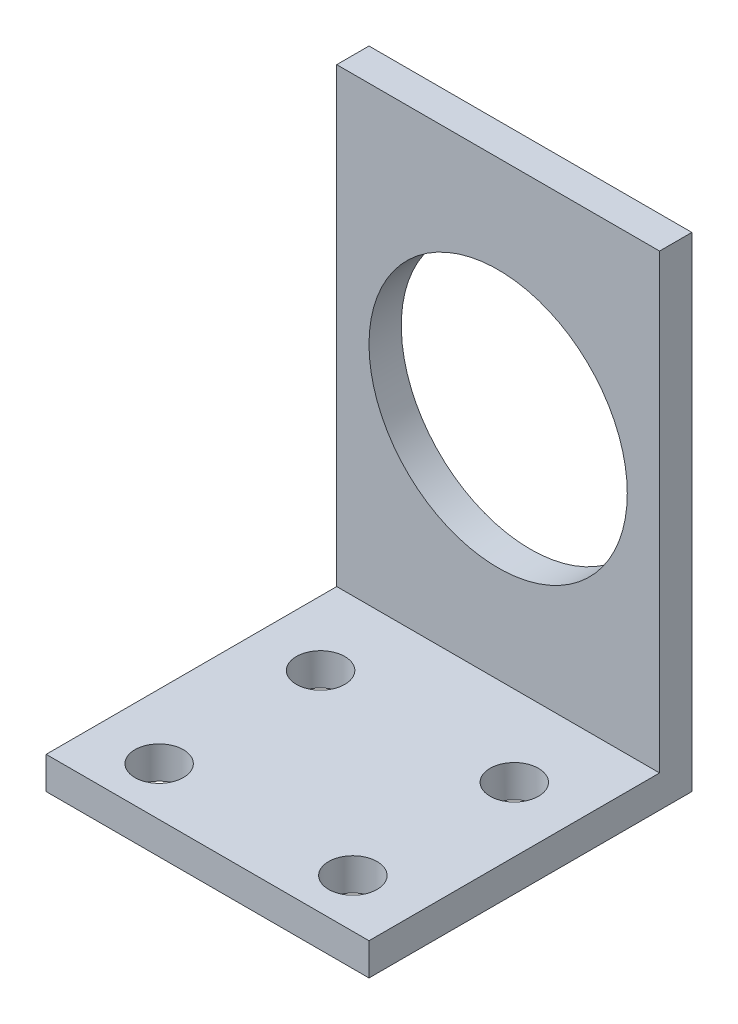
ISO-10303-21;
HEADER;
FILE_DESCRIPTION(('STEP AP214'),'2;1');
FILE_NAME('part.step','',(''),(''),'','','');
FILE_SCHEMA(('AUTOMOTIVE_DESIGN { 1 0 10303 214 1 1 1 1 }'));
ENDSEC;
DATA;
#1=APPLICATION_CONTEXT('core data for automotive mechanical design processes');
#2=APPLICATION_PROTOCOL_DEFINITION('international standard','automotive_design',2000,#1);
#3=PRODUCT_CONTEXT('',#1,'mechanical');
#4=PRODUCT('Part','Part','',(#3));
#5=PRODUCT_RELATED_PRODUCT_CATEGORY('part','',(#4));
#6=PRODUCT_DEFINITION_FORMATION('','',#4);
#7=PRODUCT_DEFINITION_CONTEXT('part definition',#1,'design');
#8=PRODUCT_DEFINITION('design','',#6,#7);
#9=PRODUCT_DEFINITION_SHAPE('','',#8);
#10=(LENGTH_UNIT() NAMED_UNIT(*) SI_UNIT(.MILLI.,.METRE.));
#11=(NAMED_UNIT(*) PLANE_ANGLE_UNIT() SI_UNIT($,.RADIAN.));
#12=(NAMED_UNIT(*) SI_UNIT($,.STERADIAN.) SOLID_ANGLE_UNIT());
#13=UNCERTAINTY_MEASURE_WITH_UNIT(LENGTH_MEASURE(1.E-05),#10,'distance_accuracy_value','');
#14=(GEOMETRIC_REPRESENTATION_CONTEXT(3) GLOBAL_UNCERTAINTY_ASSIGNED_CONTEXT((#13)) GLOBAL_UNIT_ASSIGNED_CONTEXT((#10,
#11,#12)) REPRESENTATION_CONTEXT('',''));
#15=CARTESIAN_POINT('',(0.,0.,0.));
#16=DIRECTION('',(0.,0.,1.));
#17=DIRECTION('',(1.,0.,0.));
#18=AXIS2_PLACEMENT_3D('',#15,#16,#17);
#19=CARTESIAN_POINT('',(20.,-3.,-3.));
#20=DIRECTION('',(0.,1.,0.));
#21=DIRECTION('',(0.,0.,1.));
#22=AXIS2_PLACEMENT_3D('',#19,#20,#21);
#23=PLANE('',#22);
#24=CARTESIAN_POINT('',(4.,-3.,14.));
#25=DIRECTION('',(0.,1.,0.));
#26=DIRECTION('',(0.,0.,1.));
#27=AXIS2_PLACEMENT_3D('',#24,#25,#26);
#28=CIRCLE('',#27,1.5);
#29=CARTESIAN_POINT('',(4.,-3.,15.5));
#30=VERTEX_POINT('',#29);
#31=EDGE_CURVE('E104',#30,#30,#28,.T.);
#32=ORIENTED_EDGE('',*,*,#31,.T.);
#33=EDGE_LOOP('',(#32));
#34=FACE_BOUND('',#33,.T.);
#35=CARTESIAN_POINT('',(16.,-3.,14.));
#36=DIRECTION('',(0.,1.,0.));
#37=DIRECTION('',(0.,0.,1.));
#38=AXIS2_PLACEMENT_3D('',#35,#36,#37);
#39=CIRCLE('',#38,1.5);
#40=CARTESIAN_POINT('',(16.,-3.,15.5));
#41=VERTEX_POINT('',#40);
#42=EDGE_CURVE('E182',#41,#41,#39,.T.);
#43=ORIENTED_EDGE('',*,*,#42,.T.);
#44=EDGE_LOOP('',(#43));
#45=FACE_BOUND('',#44,.T.);
#46=CARTESIAN_POINT('',(4.,-3.,4.));
#47=DIRECTION('',(0.,1.,0.));
#48=DIRECTION('',(0.,0.,1.));
#49=AXIS2_PLACEMENT_3D('',#46,#47,#48);
#50=CIRCLE('',#49,1.5);
#51=CARTESIAN_POINT('',(4.,-3.,5.5));
#52=VERTEX_POINT('',#51);
#53=EDGE_CURVE('E142',#52,#52,#50,.F.);
#54=ORIENTED_EDGE('',*,*,#53,.F.);
#55=EDGE_LOOP('',(#54));
#56=FACE_BOUND('',#55,.T.);
#57=CARTESIAN_POINT('',(16.,-3.,4.));
#58=DIRECTION('',(0.,1.,0.));
#59=DIRECTION('',(0.,0.,1.));
#60=AXIS2_PLACEMENT_3D('',#57,#58,#59);
#61=CIRCLE('',#60,1.5);
#62=CARTESIAN_POINT('',(16.,-3.,5.5));
#63=VERTEX_POINT('',#62);
#64=EDGE_CURVE('E139',#63,#63,#61,.F.);
#65=ORIENTED_EDGE('',*,*,#64,.F.);
#66=EDGE_LOOP('',(#65));
#67=FACE_BOUND('',#66,.T.);
#68=DIRECTION('',(1.,0.,0.));
#69=VECTOR('',#68,1.);
#70=CARTESIAN_POINT('',(0.,-3.00000000000001,17.));
#71=LINE('',#70,#69);
#72=CARTESIAN_POINT('',(0.,-3.00000000000001,17.));
#73=VERTEX_POINT('',#72);
#74=CARTESIAN_POINT('',(20.,-3.00000000000001,17.));
#75=VERTEX_POINT('',#74);
#76=EDGE_CURVE('E123',#73,#75,#71,.T.);
#77=ORIENTED_EDGE('',*,*,#76,.F.);
#78=DIRECTION('',(0.,0.,-1.));
#79=VECTOR('',#78,1.);
#80=CARTESIAN_POINT('',(0.,-3.,-3.));
#81=LINE('',#80,#79);
#82=CARTESIAN_POINT('',(0.,-3.,-3.));
#83=VERTEX_POINT('',#82);
#84=EDGE_CURVE('E148',#73,#83,#81,.T.);
#85=ORIENTED_EDGE('',*,*,#84,.T.);
#86=DIRECTION('',(-1.,0.,0.));
#87=VECTOR('',#86,1.);
#88=CARTESIAN_POINT('',(20.,-3.,-3.));
#89=LINE('',#88,#87);
#90=CARTESIAN_POINT('',(20.,-3.,-3.));
#91=VERTEX_POINT('',#90);
#92=EDGE_CURVE('E11',#91,#83,#89,.T.);
#93=ORIENTED_EDGE('',*,*,#92,.F.);
#94=DIRECTION('',(0.,0.,-1.));
#95=VECTOR('',#94,1.);
#96=CARTESIAN_POINT('',(20.,-3.,-3.));
#97=LINE('',#96,#95);
#98=EDGE_CURVE('E149',#75,#91,#97,.T.);
#99=ORIENTED_EDGE('',*,*,#98,.F.);
#100=EDGE_LOOP('',(#77,#85,#93,#99));
#101=FACE_BOUND('',#100,.T.);
#102=ADVANCED_FACE('F33',(#34,#45,#56,#67,#101),#23,.F.);
#103=CARTESIAN_POINT('',(20.,0.,0.));
#104=DIRECTION('',(1.,0.,0.));
#105=DIRECTION('',(0.,0.,-1.));
#106=AXIS2_PLACEMENT_3D('',#103,#104,#105);
#107=PLANE('',#106);
#108=DIRECTION('',(0.,1.,0.));
#109=VECTOR('',#108,1.);
#110=CARTESIAN_POINT('',(20.,27.,-1.));
#111=LINE('',#110,#109);
#112=CARTESIAN_POINT('',(20.,-1.,-1.));
#113=VERTEX_POINT('',#112);
#114=CARTESIAN_POINT('',(20.,27.,-1.));
#115=VERTEX_POINT('',#114);
#116=EDGE_CURVE('E55',#113,#115,#111,.T.);
#117=ORIENTED_EDGE('',*,*,#116,.F.);
#118=DIRECTION('',(0.,0.,-1.));
#119=VECTOR('',#118,1.);
#120=CARTESIAN_POINT('',(20.,-1.,-1.));
#121=LINE('',#120,#119);
#122=CARTESIAN_POINT('',(20.,-1.,17.));
#123=VERTEX_POINT('',#122);
#124=EDGE_CURVE('E89',#123,#113,#121,.T.);
#125=ORIENTED_EDGE('',*,*,#124,.F.);
#126=DIRECTION('',(0.,1.,0.));
#127=VECTOR('',#126,1.);
#128=CARTESIAN_POINT('',(20.,0.,17.));
#129=LINE('',#128,#127);
#130=EDGE_CURVE('E125',#75,#123,#129,.T.);
#131=ORIENTED_EDGE('',*,*,#130,.F.);
#132=ORIENTED_EDGE('',*,*,#98,.T.);
#133=DIRECTION('',(0.,1.,0.));
#134=VECTOR('',#133,1.);
#135=CARTESIAN_POINT('',(20.,22.,-3.));
#136=LINE('',#135,#134);
#137=CARTESIAN_POINT('',(20.,27.,-3.));
#138=VERTEX_POINT('',#137);
#139=EDGE_CURVE('E40',#91,#138,#136,.T.);
#140=ORIENTED_EDGE('',*,*,#139,.T.);
#141=DIRECTION('',(0.,0.,-1.));
#142=VECTOR('',#141,1.);
#143=CARTESIAN_POINT('',(20.,27.,-3.));
#144=LINE('',#143,#142);
#145=EDGE_CURVE('E92',#115,#138,#144,.T.);
#146=ORIENTED_EDGE('',*,*,#145,.F.);
#147=EDGE_LOOP('',(#117,#125,#131,#132,#140,#146));
#148=FACE_BOUND('',#147,.T.);
#149=ADVANCED_FACE('F86',(#148),#107,.T.);
#150=CARTESIAN_POINT('',(0.,0.,0.));
#151=DIRECTION('',(1.,0.,0.));
#152=DIRECTION('',(0.,0.,-1.));
#153=AXIS2_PLACEMENT_3D('',#150,#151,#152);
#154=PLANE('',#153);
#155=DIRECTION('',(0.,0.,1.));
#156=VECTOR('',#155,1.);
#157=CARTESIAN_POINT('',(0.,-1.,-1.));
#158=LINE('',#157,#156);
#159=CARTESIAN_POINT('',(0.,-1.,-1.));
#160=VERTEX_POINT('',#159);
#161=CARTESIAN_POINT('',(0.,-1.,17.));
#162=VERTEX_POINT('',#161);
#163=EDGE_CURVE('E47',#160,#162,#158,.T.);
#164=ORIENTED_EDGE('',*,*,#163,.F.);
#165=DIRECTION('',(0.,-1.,0.));
#166=VECTOR('',#165,1.);
#167=CARTESIAN_POINT('',(0.,27.,-1.));
#168=LINE('',#167,#166);
#169=CARTESIAN_POINT('',(0.,27.,-1.));
#170=VERTEX_POINT('',#169);
#171=EDGE_CURVE('E94',#170,#160,#168,.T.);
#172=ORIENTED_EDGE('',*,*,#171,.F.);
#173=DIRECTION('',(0.,0.,1.));
#174=VECTOR('',#173,1.);
#175=CARTESIAN_POINT('',(0.,27.,-3.));
#176=LINE('',#175,#174);
#177=CARTESIAN_POINT('',(0.,27.,-3.));
#178=VERTEX_POINT('',#177);
#179=EDGE_CURVE('E132',#178,#170,#176,.T.);
#180=ORIENTED_EDGE('',*,*,#179,.F.);
#181=DIRECTION('',(0.,1.,0.));
#182=VECTOR('',#181,1.);
#183=CARTESIAN_POINT('',(0.,22.,-3.));
#184=LINE('',#183,#182);
#185=EDGE_CURVE('E151',#83,#178,#184,.T.);
#186=ORIENTED_EDGE('',*,*,#185,.F.);
#187=ORIENTED_EDGE('',*,*,#84,.F.);
#188=DIRECTION('',(0.,-1.,0.));
#189=VECTOR('',#188,1.);
#190=CARTESIAN_POINT('',(0.,0.,17.));
#191=LINE('',#190,#189);
#192=EDGE_CURVE('E121',#162,#73,#191,.T.);
#193=ORIENTED_EDGE('',*,*,#192,.F.);
#194=EDGE_LOOP('',(#164,#172,#180,#186,#187,#193));
#195=FACE_BOUND('',#194,.T.);
#196=ADVANCED_FACE('F164',(#195),#154,.F.);
#197=CARTESIAN_POINT('',(10.,13.,-3.001));
#198=DIRECTION('',(0.,0.,1.));
#199=DIRECTION('',(1.,0.,0.));
#200=AXIS2_PLACEMENT_3D('',#197,#198,#199);
#201=CYLINDRICAL_SURFACE('',#200,8.);
#202=CARTESIAN_POINT('',(10.,13.,-3.));
#203=DIRECTION('',(0.,0.,1.));
#204=DIRECTION('',(0.,-1.,0.));
#205=AXIS2_PLACEMENT_3D('',#202,#203,#204);
#206=CIRCLE('',#205,8.);
#207=CARTESIAN_POINT('',(10.,5.,-3.));
#208=VERTEX_POINT('',#207);
#209=EDGE_CURVE('E145',#208,#208,#206,.F.);
#210=ORIENTED_EDGE('',*,*,#209,.T.);
#211=EDGE_LOOP('',(#210));
#212=FACE_BOUND('',#211,.T.);
#213=CARTESIAN_POINT('',(10.,13.,-1.));
#214=DIRECTION('',(0.,0.,1.));
#215=DIRECTION('',(1.,0.,0.));
#216=AXIS2_PLACEMENT_3D('',#213,#214,#215);
#217=CIRCLE('',#216,8.);
#218=CARTESIAN_POINT('',(18.,13.,-1.));
#219=VERTEX_POINT('',#218);
#220=EDGE_CURVE('E129',#219,#219,#217,.F.);
#221=ORIENTED_EDGE('',*,*,#220,.F.);
#222=EDGE_LOOP('',(#221));
#223=FACE_BOUND('',#222,.T.);
#224=ADVANCED_FACE('F201',(#212,#223),#201,.F.);
#225=CARTESIAN_POINT('',(0.,27.,0.));
#226=DIRECTION('',(0.,1.,0.));
#227=DIRECTION('',(0.,0.,1.));
#228=AXIS2_PLACEMENT_3D('',#225,#226,#227);
#229=PLANE('',#228);
#230=ORIENTED_EDGE('',*,*,#179,.T.);
#231=DIRECTION('',(-1.,0.,0.));
#232=VECTOR('',#231,1.);
#233=CARTESIAN_POINT('',(0.,27.,-1.));
#234=LINE('',#233,#232);
#235=EDGE_CURVE('E93',#115,#170,#234,.T.);
#236=ORIENTED_EDGE('',*,*,#235,.F.);
#237=ORIENTED_EDGE('',*,*,#145,.T.);
#238=DIRECTION('',(-1.,0.,0.));
#239=VECTOR('',#238,1.);
#240=CARTESIAN_POINT('',(0.,27.,-3.));
#241=LINE('',#240,#239);
#242=EDGE_CURVE('E136',#138,#178,#241,.T.);
#243=ORIENTED_EDGE('',*,*,#242,.T.);
#244=EDGE_LOOP('',(#230,#236,#237,#243));
#245=FACE_BOUND('',#244,.T.);
#246=ADVANCED_FACE('F163',(#245),#229,.T.);
#247=CARTESIAN_POINT('',(20.,22.,-3.));
#248=DIRECTION('',(0.,0.,1.));
#249=DIRECTION('',(0.,-1.,0.));
#250=AXIS2_PLACEMENT_3D('',#247,#248,#249);
#251=PLANE('',#250);
#252=ORIENTED_EDGE('',*,*,#209,.F.);
#253=EDGE_LOOP('',(#252));
#254=FACE_BOUND('',#253,.T.);
#255=ORIENTED_EDGE('',*,*,#185,.T.);
#256=ORIENTED_EDGE('',*,*,#242,.F.);
#257=ORIENTED_EDGE('',*,*,#139,.F.);
#258=ORIENTED_EDGE('',*,*,#92,.T.);
#259=EDGE_LOOP('',(#255,#256,#257,#258));
#260=FACE_BOUND('',#259,.T.);
#261=ADVANCED_FACE('F156',(#254,#260),#251,.F.);
#262=CARTESIAN_POINT('',(4.,-3.00100000000001,4.));
#263=DIRECTION('',(0.,1.,0.));
#264=DIRECTION('',(0.,0.,1.));
#265=AXIS2_PLACEMENT_3D('',#262,#263,#264);
#266=CYLINDRICAL_SURFACE('',#265,1.5);
#267=CARTESIAN_POINT('',(4.,-1.,4.));
#268=DIRECTION('',(0.,-1.,0.));
#269=DIRECTION('',(0.,0.,-1.));
#270=AXIS2_PLACEMENT_3D('',#267,#268,#269);
#271=CIRCLE('',#270,1.5);
#272=CARTESIAN_POINT('',(4.,-1.,2.5));
#273=VERTEX_POINT('',#272);
#274=EDGE_CURVE('E118',#273,#273,#271,.F.);
#275=ORIENTED_EDGE('',*,*,#274,.T.);
#276=EDGE_LOOP('',(#275));
#277=FACE_BOUND('',#276,.T.);
#278=ORIENTED_EDGE('',*,*,#53,.T.);
#279=EDGE_LOOP('',(#278));
#280=FACE_BOUND('',#279,.T.);
#281=ADVANCED_FACE('F189',(#277,#280),#266,.F.);
#282=CARTESIAN_POINT('',(16.,-3.00100000000001,4.));
#283=DIRECTION('',(0.,1.,0.));
#284=DIRECTION('',(0.,0.,1.));
#285=AXIS2_PLACEMENT_3D('',#282,#283,#284);
#286=CYLINDRICAL_SURFACE('',#285,1.5);
#287=CARTESIAN_POINT('',(16.,-1.,4.));
#288=DIRECTION('',(0.,-1.,0.));
#289=DIRECTION('',(0.,0.,-1.));
#290=AXIS2_PLACEMENT_3D('',#287,#288,#289);
#291=CIRCLE('',#290,1.5);
#292=CARTESIAN_POINT('',(16.,-1.,2.5));
#293=VERTEX_POINT('',#292);
#294=EDGE_CURVE('E115',#293,#293,#291,.F.);
#295=ORIENTED_EDGE('',*,*,#294,.T.);
#296=EDGE_LOOP('',(#295));
#297=FACE_BOUND('',#296,.T.);
#298=ORIENTED_EDGE('',*,*,#64,.T.);
#299=EDGE_LOOP('',(#298));
#300=FACE_BOUND('',#299,.T.);
#301=ADVANCED_FACE('F187',(#297,#300),#286,.F.);
#302=CARTESIAN_POINT('',(0.,0.,-1.));
#303=DIRECTION('',(0.,0.,1.));
#304=DIRECTION('',(1.,0.,0.));
#305=AXIS2_PLACEMENT_3D('',#302,#303,#304);
#306=PLANE('',#305);
#307=ORIENTED_EDGE('',*,*,#171,.T.);
#308=DIRECTION('',(-1.,0.,0.));
#309=VECTOR('',#308,1.);
#310=CARTESIAN_POINT('',(20.,-1.,-1.));
#311=LINE('',#310,#309);
#312=EDGE_CURVE('E96',#113,#160,#311,.T.);
#313=ORIENTED_EDGE('',*,*,#312,.F.);
#314=ORIENTED_EDGE('',*,*,#116,.T.);
#315=ORIENTED_EDGE('',*,*,#235,.T.);
#316=EDGE_LOOP('',(#307,#313,#314,#315));
#317=FACE_BOUND('',#316,.T.);
#318=ORIENTED_EDGE('',*,*,#220,.T.);
#319=EDGE_LOOP('',(#318));
#320=FACE_BOUND('',#319,.T.);
#321=ADVANCED_FACE('F97',(#317,#320),#306,.T.);
#322=CARTESIAN_POINT('',(0.,0.,17.));
#323=DIRECTION('',(0.,0.,1.));
#324=DIRECTION('',(1.,0.,0.));
#325=AXIS2_PLACEMENT_3D('',#322,#323,#324);
#326=PLANE('',#325);
#327=DIRECTION('',(1.,0.,0.));
#328=VECTOR('',#327,1.);
#329=CARTESIAN_POINT('',(20.,-1.,17.));
#330=LINE('',#329,#328);
#331=EDGE_CURVE('E103',#162,#123,#330,.T.);
#332=ORIENTED_EDGE('',*,*,#331,.F.);
#333=ORIENTED_EDGE('',*,*,#192,.T.);
#334=ORIENTED_EDGE('',*,*,#76,.T.);
#335=ORIENTED_EDGE('',*,*,#130,.T.);
#336=EDGE_LOOP('',(#332,#333,#334,#335));
#337=FACE_BOUND('',#336,.T.);
#338=ADVANCED_FACE('F168',(#337),#326,.T.);
#339=CARTESIAN_POINT('',(0.,-1.,0.));
#340=DIRECTION('',(0.,-1.,0.));
#341=DIRECTION('',(0.,0.,-1.));
#342=AXIS2_PLACEMENT_3D('',#339,#340,#341);
#343=PLANE('',#342);
#344=CARTESIAN_POINT('',(4.,-1.,14.));
#345=DIRECTION('',(0.,1.,0.));
#346=DIRECTION('',(0.,0.,1.));
#347=AXIS2_PLACEMENT_3D('',#344,#345,#346);
#348=CIRCLE('',#347,1.5);
#349=CARTESIAN_POINT('',(4.,-1.,15.5));
#350=VERTEX_POINT('',#349);
#351=EDGE_CURVE('E107',#350,#350,#348,.T.);
#352=ORIENTED_EDGE('',*,*,#351,.F.);
#353=EDGE_LOOP('',(#352));
#354=FACE_BOUND('',#353,.T.);
#355=CARTESIAN_POINT('',(16.,-1.,14.));
#356=DIRECTION('',(0.,1.,0.));
#357=DIRECTION('',(0.,0.,1.));
#358=AXIS2_PLACEMENT_3D('',#355,#356,#357);
#359=CIRCLE('',#358,1.5);
#360=CARTESIAN_POINT('',(16.,-1.,15.5));
#361=VERTEX_POINT('',#360);
#362=EDGE_CURVE('E110',#361,#361,#359,.T.);
#363=ORIENTED_EDGE('',*,*,#362,.F.);
#364=EDGE_LOOP('',(#363));
#365=FACE_BOUND('',#364,.T.);
#366=ORIENTED_EDGE('',*,*,#294,.F.);
#367=EDGE_LOOP('',(#366));
#368=FACE_BOUND('',#367,.T.);
#369=ORIENTED_EDGE('',*,*,#124,.T.);
#370=ORIENTED_EDGE('',*,*,#312,.T.);
#371=ORIENTED_EDGE('',*,*,#163,.T.);
#372=ORIENTED_EDGE('',*,*,#331,.T.);
#373=EDGE_LOOP('',(#369,#370,#371,#372));
#374=FACE_BOUND('',#373,.T.);
#375=ORIENTED_EDGE('',*,*,#274,.F.);
#376=EDGE_LOOP('',(#375));
#377=FACE_BOUND('',#376,.T.);
#378=ADVANCED_FACE('F101',(#354,#365,#368,#374,#377),#343,.F.);
#379=CARTESIAN_POINT('',(16.,-3.,14.));
#380=DIRECTION('',(0.,1.,0.));
#381=DIRECTION('',(0.,0.,1.));
#382=AXIS2_PLACEMENT_3D('',#379,#380,#381);
#383=CYLINDRICAL_SURFACE('',#382,1.5);
#384=ORIENTED_EDGE('',*,*,#42,.F.);
#385=EDGE_LOOP('',(#384));
#386=FACE_BOUND('',#385,.T.);
#387=ORIENTED_EDGE('',*,*,#362,.T.);
#388=EDGE_LOOP('',(#387));
#389=FACE_BOUND('',#388,.T.);
#390=ADVANCED_FACE('F262',(#386,#389),#383,.F.);
#391=CARTESIAN_POINT('',(4.,-3.,14.));
#392=DIRECTION('',(0.,1.,0.));
#393=DIRECTION('',(0.,0.,1.));
#394=AXIS2_PLACEMENT_3D('',#391,#392,#393);
#395=CYLINDRICAL_SURFACE('',#394,1.5);
#396=ORIENTED_EDGE('',*,*,#31,.F.);
#397=EDGE_LOOP('',(#396));
#398=FACE_BOUND('',#397,.T.);
#399=ORIENTED_EDGE('',*,*,#351,.T.);
#400=EDGE_LOOP('',(#399));
#401=FACE_BOUND('',#400,.T.);
#402=ADVANCED_FACE('F271',(#398,#401),#395,.F.);
#403=CLOSED_SHELL('',(#102,#149,#196,#224,#246,#261,#281,#301,#321,#338,#378,#390,#402));
#404=MANIFOLD_SOLID_BREP('B2',#403);
#405=ADVANCED_BREP_SHAPE_REPRESENTATION('',(#18,#404),#14);
#406=SHAPE_DEFINITION_REPRESENTATION(#9,#405);
ENDSEC;
END-ISO-10303-21;
